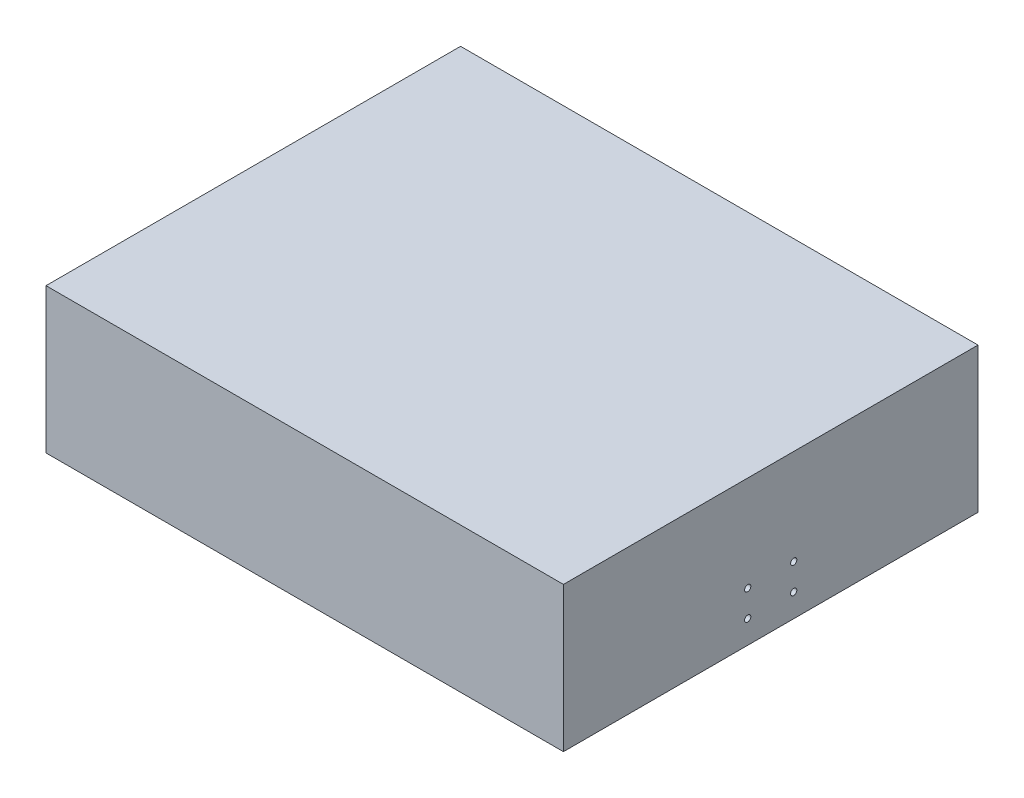
ISO-10303-21;
HEADER;
FILE_DESCRIPTION(('STEP AP214'),'2;1');
FILE_NAME('part.step','',(''),(''),'','','');
FILE_SCHEMA(('AUTOMOTIVE_DESIGN { 1 0 10303 214 1 1 1 1 }'));
ENDSEC;
DATA;
#1=APPLICATION_CONTEXT('core data for automotive mechanical design processes');
#2=APPLICATION_PROTOCOL_DEFINITION('international standard','automotive_design',2000,#1);
#3=PRODUCT_CONTEXT('',#1,'mechanical');
#4=PRODUCT('Part','Part','',(#3));
#5=PRODUCT_RELATED_PRODUCT_CATEGORY('part','',(#4));
#6=PRODUCT_DEFINITION_FORMATION('','',#4);
#7=PRODUCT_DEFINITION_CONTEXT('part definition',#1,'design');
#8=PRODUCT_DEFINITION('design','',#6,#7);
#9=PRODUCT_DEFINITION_SHAPE('','',#8);
#10=(LENGTH_UNIT() NAMED_UNIT(*) SI_UNIT(.MILLI.,.METRE.));
#11=(NAMED_UNIT(*) PLANE_ANGLE_UNIT() SI_UNIT($,.RADIAN.));
#12=(NAMED_UNIT(*) SI_UNIT($,.STERADIAN.) SOLID_ANGLE_UNIT());
#13=UNCERTAINTY_MEASURE_WITH_UNIT(LENGTH_MEASURE(1.E-05),#10,'distance_accuracy_value','');
#14=(GEOMETRIC_REPRESENTATION_CONTEXT(3) GLOBAL_UNCERTAINTY_ASSIGNED_CONTEXT((#13)) GLOBAL_UNIT_ASSIGNED_CONTEXT((#10,
#11,#12)) REPRESENTATION_CONTEXT('',''));
#15=CARTESIAN_POINT('',(0.,0.,0.));
#16=DIRECTION('',(0.,0.,1.));
#17=DIRECTION('',(1.,0.,0.));
#18=AXIS2_PLACEMENT_3D('',#15,#16,#17);
#19=CARTESIAN_POINT('',(-125.,70.,100.15));
#20=DIRECTION('',(1.,0.,0.));
#21=DIRECTION('',(0.,0.,-1.));
#22=AXIS2_PLACEMENT_3D('',#19,#20,#21);
#23=PLANE('',#22);
#24=DIRECTION('',(0.,0.,1.));
#25=VECTOR('',#24,1.);
#26=CARTESIAN_POINT('',(-125.,0.,100.15));
#27=LINE('',#26,#25);
#28=CARTESIAN_POINT('',(-125.,0.,-100.15));
#29=VERTEX_POINT('',#28);
#30=CARTESIAN_POINT('',(-125.,0.,100.15));
#31=VERTEX_POINT('',#30);
#32=EDGE_CURVE('E168',#29,#31,#27,.T.);
#33=ORIENTED_EDGE('',*,*,#32,.T.);
#34=DIRECTION('',(0.,-1.,0.));
#35=VECTOR('',#34,1.);
#36=CARTESIAN_POINT('',(-125.,70.,100.15));
#37=LINE('',#36,#35);
#38=CARTESIAN_POINT('',(-125.,70.,100.15));
#39=VERTEX_POINT('',#38);
#40=EDGE_CURVE('E11',#39,#31,#37,.T.);
#41=ORIENTED_EDGE('',*,*,#40,.F.);
#42=DIRECTION('',(0.,0.,1.));
#43=VECTOR('',#42,1.);
#44=CARTESIAN_POINT('',(-125.,70.,100.15));
#45=LINE('',#44,#43);
#46=CARTESIAN_POINT('',(-125.,70.,-100.15));
#47=VERTEX_POINT('',#46);
#48=EDGE_CURVE('E174',#47,#39,#45,.T.);
#49=ORIENTED_EDGE('',*,*,#48,.F.);
#50=DIRECTION('',(0.,-1.,0.));
#51=VECTOR('',#50,1.);
#52=CARTESIAN_POINT('',(-125.,70.,-100.15));
#53=LINE('',#52,#51);
#54=EDGE_CURVE('E184',#47,#29,#53,.T.);
#55=ORIENTED_EDGE('',*,*,#54,.T.);
#56=EDGE_LOOP('',(#33,#41,#49,#55));
#57=FACE_BOUND('',#56,.T.);
#58=ADVANCED_FACE('F45',(#57),#23,.F.);
#59=CARTESIAN_POINT('',(125.,70.,100.15));
#60=DIRECTION('',(0.,0.,-1.));
#61=DIRECTION('',(-1.,0.,0.));
#62=AXIS2_PLACEMENT_3D('',#59,#60,#61);
#63=PLANE('',#62);
#64=DIRECTION('',(1.,0.,0.));
#65=VECTOR('',#64,1.);
#66=CARTESIAN_POINT('',(125.,0.,100.15));
#67=LINE('',#66,#65);
#68=CARTESIAN_POINT('',(125.,0.,100.15));
#69=VERTEX_POINT('',#68);
#70=EDGE_CURVE('E188',#31,#69,#67,.T.);
#71=ORIENTED_EDGE('',*,*,#70,.T.);
#72=DIRECTION('',(0.,-1.,0.));
#73=VECTOR('',#72,1.);
#74=CARTESIAN_POINT('',(125.,70.,100.15));
#75=LINE('',#74,#73);
#76=CARTESIAN_POINT('',(125.,70.,100.15));
#77=VERTEX_POINT('',#76);
#78=EDGE_CURVE('E53',#77,#69,#75,.T.);
#79=ORIENTED_EDGE('',*,*,#78,.F.);
#80=DIRECTION('',(1.,0.,0.));
#81=VECTOR('',#80,1.);
#82=CARTESIAN_POINT('',(125.,70.,100.15));
#83=LINE('',#82,#81);
#84=EDGE_CURVE('E97',#39,#77,#83,.T.);
#85=ORIENTED_EDGE('',*,*,#84,.F.);
#86=ORIENTED_EDGE('',*,*,#40,.T.);
#87=EDGE_LOOP('',(#71,#79,#85,#86));
#88=FACE_BOUND('',#87,.T.);
#89=ADVANCED_FACE('F223',(#88),#63,.F.);
#90=CARTESIAN_POINT('',(125.,70.,-100.15));
#91=DIRECTION('',(-1.,0.,0.));
#92=DIRECTION('',(0.,0.,1.));
#93=AXIS2_PLACEMENT_3D('',#90,#91,#92);
#94=PLANE('',#93);
#95=CARTESIAN_POINT('',(125.,23.9000761563583,-11.1099999998695));
#96=DIRECTION('',(1.,0.,0.));
#97=DIRECTION('',(0.,0.,-1.));
#98=AXIS2_PLACEMENT_3D('',#95,#96,#97);
#99=CIRCLE('',#98,1.5);
#100=CARTESIAN_POINT('',(125.,23.9000761563583,-12.6099999998695));
#101=VERTEX_POINT('',#100);
#102=EDGE_CURVE('E497',#101,#101,#99,.T.);
#103=ORIENTED_EDGE('',*,*,#102,.F.);
#104=EDGE_LOOP('',(#103));
#105=FACE_BOUND('',#104,.T.);
#106=CARTESIAN_POINT('',(125.,11.2,11.115));
#107=DIRECTION('',(1.,0.,0.));
#108=DIRECTION('',(0.,0.,-1.));
#109=AXIS2_PLACEMENT_3D('',#106,#107,#108);
#110=CIRCLE('',#109,1.5);
#111=CARTESIAN_POINT('',(125.,11.2,9.615));
#112=VERTEX_POINT('',#111);
#113=EDGE_CURVE('E505',#112,#112,#110,.T.);
#114=ORIENTED_EDGE('',*,*,#113,.F.);
#115=EDGE_LOOP('',(#114));
#116=FACE_BOUND('',#115,.T.);
#117=CARTESIAN_POINT('',(125.,11.2,-11.11));
#118=DIRECTION('',(1.,0.,0.));
#119=DIRECTION('',(0.,0.,-1.));
#120=AXIS2_PLACEMENT_3D('',#117,#118,#119);
#121=CIRCLE('',#120,1.5);
#122=CARTESIAN_POINT('',(125.,11.2,-12.61));
#123=VERTEX_POINT('',#122);
#124=EDGE_CURVE('E489',#123,#123,#121,.T.);
#125=ORIENTED_EDGE('',*,*,#124,.F.);
#126=EDGE_LOOP('',(#125));
#127=FACE_BOUND('',#126,.T.);
#128=CARTESIAN_POINT('',(125.,23.9,11.115));
#129=DIRECTION('',(1.,0.,0.));
#130=DIRECTION('',(0.,0.,-1.));
#131=AXIS2_PLACEMENT_3D('',#128,#129,#130);
#132=CIRCLE('',#131,1.5);
#133=CARTESIAN_POINT('',(125.,23.9,9.615));
#134=VERTEX_POINT('',#133);
#135=EDGE_CURVE('E149',#134,#134,#132,.T.);
#136=ORIENTED_EDGE('',*,*,#135,.F.);
#137=EDGE_LOOP('',(#136));
#138=FACE_BOUND('',#137,.T.);
#139=DIRECTION('',(0.,0.,-1.));
#140=VECTOR('',#139,1.);
#141=CARTESIAN_POINT('',(125.,0.,-100.15));
#142=LINE('',#141,#140);
#143=CARTESIAN_POINT('',(125.,0.,-100.15));
#144=VERTEX_POINT('',#143);
#145=EDGE_CURVE('E191',#69,#144,#142,.T.);
#146=ORIENTED_EDGE('',*,*,#145,.T.);
#147=DIRECTION('',(0.,-1.,0.));
#148=VECTOR('',#147,1.);
#149=CARTESIAN_POINT('',(125.,70.,-100.15));
#150=LINE('',#149,#148);
#151=CARTESIAN_POINT('',(125.,70.,-100.15));
#152=VERTEX_POINT('',#151);
#153=EDGE_CURVE('E198',#152,#144,#150,.T.);
#154=ORIENTED_EDGE('',*,*,#153,.F.);
#155=DIRECTION('',(0.,0.,-1.));
#156=VECTOR('',#155,1.);
#157=CARTESIAN_POINT('',(125.,70.,-100.15));
#158=LINE('',#157,#156);
#159=EDGE_CURVE('E179',#77,#152,#158,.T.);
#160=ORIENTED_EDGE('',*,*,#159,.F.);
#161=ORIENTED_EDGE('',*,*,#78,.T.);
#162=EDGE_LOOP('',(#146,#154,#160,#161));
#163=FACE_BOUND('',#162,.T.);
#164=ADVANCED_FACE('F205',(#105,#116,#127,#138,#163),#94,.F.);
#165=CARTESIAN_POINT('',(-125.,70.,-100.15));
#166=DIRECTION('',(0.,0.,1.));
#167=DIRECTION('',(1.,0.,0.));
#168=AXIS2_PLACEMENT_3D('',#165,#166,#167);
#169=PLANE('',#168);
#170=DIRECTION('',(-1.,0.,0.));
#171=VECTOR('',#170,1.);
#172=CARTESIAN_POINT('',(-125.,0.,-100.15));
#173=LINE('',#172,#171);
#174=EDGE_CURVE('E90',#144,#29,#173,.T.);
#175=ORIENTED_EDGE('',*,*,#174,.T.);
#176=ORIENTED_EDGE('',*,*,#54,.F.);
#177=DIRECTION('',(-1.,0.,0.));
#178=VECTOR('',#177,1.);
#179=CARTESIAN_POINT('',(-125.,70.,-100.15));
#180=LINE('',#179,#178);
#181=EDGE_CURVE('E69',#152,#47,#180,.T.);
#182=ORIENTED_EDGE('',*,*,#181,.F.);
#183=ORIENTED_EDGE('',*,*,#153,.T.);
#184=EDGE_LOOP('',(#175,#176,#182,#183));
#185=FACE_BOUND('',#184,.T.);
#186=ADVANCED_FACE('F213',(#185),#169,.F.);
#187=CARTESIAN_POINT('',(0.,70.,0.));
#188=DIRECTION('',(0.,-1.,0.));
#189=DIRECTION('',(0.,0.,-1.));
#190=AXIS2_PLACEMENT_3D('',#187,#188,#189);
#191=PLANE('',#190);
#192=ORIENTED_EDGE('',*,*,#48,.T.);
#193=ORIENTED_EDGE('',*,*,#84,.T.);
#194=ORIENTED_EDGE('',*,*,#159,.T.);
#195=ORIENTED_EDGE('',*,*,#181,.T.);
#196=EDGE_LOOP('',(#192,#193,#194,#195));
#197=FACE_BOUND('',#196,.T.);
#198=ADVANCED_FACE('F215',(#197),#191,.F.);
#199=CARTESIAN_POINT('',(0.,0.,0.));
#200=DIRECTION('',(0.,-1.,0.));
#201=DIRECTION('',(0.,0.,-1.));
#202=AXIS2_PLACEMENT_3D('',#199,#200,#201);
#203=PLANE('',#202);
#204=CARTESIAN_POINT('',(110.,0.,95.15));
#205=DIRECTION('',(0.,-1.,0.));
#206=DIRECTION('',(0.,0.,-1.));
#207=AXIS2_PLACEMENT_3D('',#204,#205,#206);
#208=CIRCLE('',#207,2.5);
#209=CARTESIAN_POINT('',(110.,0.,92.65));
#210=VERTEX_POINT('',#209);
#211=EDGE_CURVE('E471',#210,#210,#208,.T.);
#212=ORIENTED_EDGE('',*,*,#211,.F.);
#213=EDGE_LOOP('',(#212));
#214=FACE_BOUND('',#213,.T.);
#215=CARTESIAN_POINT('',(110.,0.,-95.15));
#216=DIRECTION('',(0.,-1.,0.));
#217=DIRECTION('',(0.,0.,-1.));
#218=AXIS2_PLACEMENT_3D('',#215,#216,#217);
#219=CIRCLE('',#218,2.50000000000001);
#220=CARTESIAN_POINT('',(110.,0.,-97.65));
#221=VERTEX_POINT('',#220);
#222=EDGE_CURVE('E526',#221,#221,#219,.T.);
#223=ORIENTED_EDGE('',*,*,#222,.F.);
#224=EDGE_LOOP('',(#223));
#225=FACE_BOUND('',#224,.T.);
#226=CARTESIAN_POINT('',(-100.15,0.,-95.15));
#227=DIRECTION('',(0.,-1.,0.));
#228=DIRECTION('',(0.,0.,-1.));
#229=AXIS2_PLACEMENT_3D('',#226,#227,#228);
#230=CIRCLE('',#229,2.5);
#231=CARTESIAN_POINT('',(-100.15,0.,-97.65));
#232=VERTEX_POINT('',#231);
#233=EDGE_CURVE('E488',#232,#232,#230,.T.);
#234=ORIENTED_EDGE('',*,*,#233,.F.);
#235=EDGE_LOOP('',(#234));
#236=FACE_BOUND('',#235,.T.);
#237=CARTESIAN_POINT('',(-100.15,0.,95.15));
#238=DIRECTION('',(0.,-1.,0.));
#239=DIRECTION('',(0.,0.,-1.));
#240=AXIS2_PLACEMENT_3D('',#237,#238,#239);
#241=CIRCLE('',#240,2.50000000000001);
#242=CARTESIAN_POINT('',(-100.15,0.,92.65));
#243=VERTEX_POINT('',#242);
#244=EDGE_CURVE('E484',#243,#243,#241,.T.);
#245=ORIENTED_EDGE('',*,*,#244,.F.);
#246=EDGE_LOOP('',(#245));
#247=FACE_BOUND('',#246,.T.);
#248=DIRECTION('',(0.,0.,-1.));
#249=VECTOR('',#248,1.);
#250=CARTESIAN_POINT('',(-115.,0.,90.15));
#251=LINE('',#250,#249);
#252=CARTESIAN_POINT('',(-115.,0.,90.15));
#253=VERTEX_POINT('',#252);
#254=CARTESIAN_POINT('',(-115.,0.,-90.15));
#255=VERTEX_POINT('',#254);
#256=EDGE_CURVE('E60',#253,#255,#251,.T.);
#257=ORIENTED_EDGE('',*,*,#256,.F.);
#258=DIRECTION('',(-1.,0.,0.));
#259=VECTOR('',#258,1.);
#260=CARTESIAN_POINT('',(-115.,0.,90.15));
#261=LINE('',#260,#259);
#262=CARTESIAN_POINT('',(115.,0.,90.15));
#263=VERTEX_POINT('',#262);
#264=EDGE_CURVE('E142',#263,#253,#261,.T.);
#265=ORIENTED_EDGE('',*,*,#264,.F.);
#266=DIRECTION('',(0.,0.,1.));
#267=VECTOR('',#266,1.);
#268=CARTESIAN_POINT('',(115.,0.,90.15));
#269=LINE('',#268,#267);
#270=CARTESIAN_POINT('',(115.,0.,-90.15));
#271=VERTEX_POINT('',#270);
#272=EDGE_CURVE('E146',#271,#263,#269,.T.);
#273=ORIENTED_EDGE('',*,*,#272,.F.);
#274=DIRECTION('',(1.,0.,0.));
#275=VECTOR('',#274,1.);
#276=CARTESIAN_POINT('',(-115.,0.,-90.15));
#277=LINE('',#276,#275);
#278=EDGE_CURVE('E158',#255,#271,#277,.T.);
#279=ORIENTED_EDGE('',*,*,#278,.F.);
#280=EDGE_LOOP('',(#257,#265,#273,#279));
#281=FACE_BOUND('',#280,.T.);
#282=ORIENTED_EDGE('',*,*,#32,.F.);
#283=ORIENTED_EDGE('',*,*,#174,.F.);
#284=ORIENTED_EDGE('',*,*,#145,.F.);
#285=ORIENTED_EDGE('',*,*,#70,.F.);
#286=EDGE_LOOP('',(#282,#283,#284,#285));
#287=FACE_BOUND('',#286,.T.);
#288=ADVANCED_FACE('F209',(#214,#225,#236,#247,#281,#287),#203,.T.);
#289=CARTESIAN_POINT('',(-115.,60.,90.15));
#290=DIRECTION('',(-1.,0.,0.));
#291=DIRECTION('',(0.,0.,1.));
#292=AXIS2_PLACEMENT_3D('',#289,#290,#291);
#293=PLANE('',#292);
#294=ORIENTED_EDGE('',*,*,#256,.T.);
#295=DIRECTION('',(0.,-1.,0.));
#296=VECTOR('',#295,1.);
#297=CARTESIAN_POINT('',(-115.,60.,-90.15));
#298=LINE('',#297,#296);
#299=CARTESIAN_POINT('',(-115.,60.,-90.15));
#300=VERTEX_POINT('',#299);
#301=EDGE_CURVE('E117',#300,#255,#298,.T.);
#302=ORIENTED_EDGE('',*,*,#301,.F.);
#303=DIRECTION('',(0.,0.,-1.));
#304=VECTOR('',#303,1.);
#305=CARTESIAN_POINT('',(-115.,60.,90.15));
#306=LINE('',#305,#304);
#307=CARTESIAN_POINT('',(-115.,60.,90.15));
#308=VERTEX_POINT('',#307);
#309=EDGE_CURVE('E121',#308,#300,#306,.T.);
#310=ORIENTED_EDGE('',*,*,#309,.F.);
#311=DIRECTION('',(0.,-1.,0.));
#312=VECTOR('',#311,1.);
#313=CARTESIAN_POINT('',(-115.,60.,90.15));
#314=LINE('',#313,#312);
#315=EDGE_CURVE('E165',#308,#253,#314,.T.);
#316=ORIENTED_EDGE('',*,*,#315,.T.);
#317=EDGE_LOOP('',(#294,#302,#310,#316));
#318=FACE_BOUND('',#317,.T.);
#319=ADVANCED_FACE('F119',(#318),#293,.F.);
#320=CARTESIAN_POINT('',(-115.,60.,90.15));
#321=DIRECTION('',(0.,0.,1.));
#322=DIRECTION('',(1.,0.,0.));
#323=AXIS2_PLACEMENT_3D('',#320,#321,#322);
#324=PLANE('',#323);
#325=ORIENTED_EDGE('',*,*,#264,.T.);
#326=ORIENTED_EDGE('',*,*,#315,.F.);
#327=DIRECTION('',(-1.,0.,0.));
#328=VECTOR('',#327,1.);
#329=CARTESIAN_POINT('',(-115.,60.,90.15));
#330=LINE('',#329,#328);
#331=CARTESIAN_POINT('',(115.,60.,90.15));
#332=VERTEX_POINT('',#331);
#333=EDGE_CURVE('E128',#332,#308,#330,.T.);
#334=ORIENTED_EDGE('',*,*,#333,.F.);
#335=DIRECTION('',(0.,-1.,0.));
#336=VECTOR('',#335,1.);
#337=CARTESIAN_POINT('',(115.,60.,90.15));
#338=LINE('',#337,#336);
#339=EDGE_CURVE('E169',#332,#263,#338,.T.);
#340=ORIENTED_EDGE('',*,*,#339,.T.);
#341=EDGE_LOOP('',(#325,#326,#334,#340));
#342=FACE_BOUND('',#341,.T.);
#343=ADVANCED_FACE('F273',(#342),#324,.F.);
#344=CARTESIAN_POINT('',(115.,60.,90.15));
#345=DIRECTION('',(1.,0.,0.));
#346=DIRECTION('',(0.,0.,-1.));
#347=AXIS2_PLACEMENT_3D('',#344,#345,#346);
#348=PLANE('',#347);
#349=ORIENTED_EDGE('',*,*,#272,.T.);
#350=ORIENTED_EDGE('',*,*,#339,.F.);
#351=DIRECTION('',(0.,0.,1.));
#352=VECTOR('',#351,1.);
#353=CARTESIAN_POINT('',(115.,60.,90.15));
#354=LINE('',#353,#352);
#355=CARTESIAN_POINT('',(115.,60.,-90.15));
#356=VERTEX_POINT('',#355);
#357=EDGE_CURVE('E137',#356,#332,#354,.T.);
#358=ORIENTED_EDGE('',*,*,#357,.F.);
#359=DIRECTION('',(0.,-1.,0.));
#360=VECTOR('',#359,1.);
#361=CARTESIAN_POINT('',(115.,60.,-90.15));
#362=LINE('',#361,#360);
#363=EDGE_CURVE('E127',#356,#271,#362,.T.);
#364=ORIENTED_EDGE('',*,*,#363,.T.);
#365=EDGE_LOOP('',(#349,#350,#358,#364));
#366=FACE_BOUND('',#365,.T.);
#367=ADVANCED_FACE('F282',(#366),#348,.F.);
#368=CARTESIAN_POINT('',(-115.,60.,-90.15));
#369=DIRECTION('',(0.,0.,-1.));
#370=DIRECTION('',(-1.,0.,0.));
#371=AXIS2_PLACEMENT_3D('',#368,#369,#370);
#372=PLANE('',#371);
#373=ORIENTED_EDGE('',*,*,#278,.T.);
#374=ORIENTED_EDGE('',*,*,#363,.F.);
#375=DIRECTION('',(1.,0.,0.));
#376=VECTOR('',#375,1.);
#377=CARTESIAN_POINT('',(-115.,60.,-90.15));
#378=LINE('',#377,#376);
#379=EDGE_CURVE('E131',#300,#356,#378,.T.);
#380=ORIENTED_EDGE('',*,*,#379,.F.);
#381=ORIENTED_EDGE('',*,*,#301,.T.);
#382=EDGE_LOOP('',(#373,#374,#380,#381));
#383=FACE_BOUND('',#382,.T.);
#384=ADVANCED_FACE('F132',(#383),#372,.F.);
#385=CARTESIAN_POINT('',(0.,60.,0.));
#386=DIRECTION('',(0.,-1.,0.));
#387=DIRECTION('',(0.,0.,-1.));
#388=AXIS2_PLACEMENT_3D('',#385,#386,#387);
#389=PLANE('',#388);
#390=ORIENTED_EDGE('',*,*,#309,.T.);
#391=ORIENTED_EDGE('',*,*,#379,.T.);
#392=ORIENTED_EDGE('',*,*,#357,.T.);
#393=ORIENTED_EDGE('',*,*,#333,.T.);
#394=EDGE_LOOP('',(#390,#391,#392,#393));
#395=FACE_BOUND('',#394,.T.);
#396=ADVANCED_FACE('F139',(#395),#389,.T.);
#397=CARTESIAN_POINT('',(120.,23.9,11.115));
#398=DIRECTION('',(1.,0.,0.));
#399=DIRECTION('',(0.,0.,-1.));
#400=AXIS2_PLACEMENT_3D('',#397,#398,#399);
#401=CYLINDRICAL_SURFACE('',#400,1.5);
#402=CARTESIAN_POINT('',(120.,23.9,11.115));
#403=DIRECTION('',(1.,0.,0.));
#404=DIRECTION('',(0.,0.,-1.));
#405=AXIS2_PLACEMENT_3D('',#402,#403,#404);
#406=CIRCLE('',#405,1.5);
#407=CARTESIAN_POINT('',(120.,23.9,9.615));
#408=VERTEX_POINT('',#407);
#409=EDGE_CURVE('E159',#408,#408,#406,.T.);
#410=ORIENTED_EDGE('',*,*,#409,.F.);
#411=EDGE_LOOP('',(#410));
#412=FACE_BOUND('',#411,.T.);
#413=ORIENTED_EDGE('',*,*,#135,.T.);
#414=EDGE_LOOP('',(#413));
#415=FACE_BOUND('',#414,.T.);
#416=ADVANCED_FACE('F308',(#412,#415),#401,.F.);
#417=CARTESIAN_POINT('',(120.,23.9,11.115));
#418=DIRECTION('',(1.,0.,0.));
#419=DIRECTION('',(0.,0.,-1.));
#420=AXIS2_PLACEMENT_3D('',#417,#418,#419);
#421=PLANE('',#420);
#422=ORIENTED_EDGE('',*,*,#409,.T.);
#423=EDGE_LOOP('',(#422));
#424=FACE_BOUND('',#423,.T.);
#425=ADVANCED_FACE('F316',(#424),#421,.T.);
#426=CARTESIAN_POINT('',(120.,11.2,-11.11));
#427=DIRECTION('',(1.,0.,0.));
#428=DIRECTION('',(0.,0.,-1.));
#429=AXIS2_PLACEMENT_3D('',#426,#427,#428);
#430=CYLINDRICAL_SURFACE('',#429,1.5);
#431=CARTESIAN_POINT('',(120.,11.2,-11.11));
#432=DIRECTION('',(1.,0.,0.));
#433=DIRECTION('',(0.,0.,-1.));
#434=AXIS2_PLACEMENT_3D('',#431,#432,#433);
#435=CIRCLE('',#434,1.5);
#436=CARTESIAN_POINT('',(120.,11.2,-12.61));
#437=VERTEX_POINT('',#436);
#438=EDGE_CURVE('E483',#437,#437,#435,.T.);
#439=ORIENTED_EDGE('',*,*,#438,.F.);
#440=EDGE_LOOP('',(#439));
#441=FACE_BOUND('',#440,.T.);
#442=ORIENTED_EDGE('',*,*,#124,.T.);
#443=EDGE_LOOP('',(#442));
#444=FACE_BOUND('',#443,.T.);
#445=ADVANCED_FACE('F326',(#441,#444),#430,.F.);
#446=CARTESIAN_POINT('',(120.,11.2,-11.11));
#447=DIRECTION('',(1.,0.,0.));
#448=DIRECTION('',(0.,0.,-1.));
#449=AXIS2_PLACEMENT_3D('',#446,#447,#448);
#450=PLANE('',#449);
#451=ORIENTED_EDGE('',*,*,#438,.T.);
#452=EDGE_LOOP('',(#451));
#453=FACE_BOUND('',#452,.T.);
#454=ADVANCED_FACE('F336',(#453),#450,.T.);
#455=CARTESIAN_POINT('',(120.,11.2,11.115));
#456=DIRECTION('',(1.,0.,0.));
#457=DIRECTION('',(0.,0.,-1.));
#458=AXIS2_PLACEMENT_3D('',#455,#456,#457);
#459=CYLINDRICAL_SURFACE('',#458,1.5);
#460=CARTESIAN_POINT('',(120.,11.2,11.115));
#461=DIRECTION('',(1.,0.,0.));
#462=DIRECTION('',(0.,0.,-1.));
#463=AXIS2_PLACEMENT_3D('',#460,#461,#462);
#464=CIRCLE('',#463,1.5);
#465=CARTESIAN_POINT('',(120.,11.2,9.615));
#466=VERTEX_POINT('',#465);
#467=EDGE_CURVE('E493',#466,#466,#464,.T.);
#468=ORIENTED_EDGE('',*,*,#467,.F.);
#469=EDGE_LOOP('',(#468));
#470=FACE_BOUND('',#469,.T.);
#471=ORIENTED_EDGE('',*,*,#113,.T.);
#472=EDGE_LOOP('',(#471));
#473=FACE_BOUND('',#472,.T.);
#474=ADVANCED_FACE('F346',(#470,#473),#459,.F.);
#475=CARTESIAN_POINT('',(120.,11.2,11.115));
#476=DIRECTION('',(1.,0.,0.));
#477=DIRECTION('',(0.,0.,-1.));
#478=AXIS2_PLACEMENT_3D('',#475,#476,#477);
#479=PLANE('',#478);
#480=ORIENTED_EDGE('',*,*,#467,.T.);
#481=EDGE_LOOP('',(#480));
#482=FACE_BOUND('',#481,.T.);
#483=ADVANCED_FACE('F356',(#482),#479,.T.);
#484=CARTESIAN_POINT('',(120.,23.9000761563583,-11.1099999998695));
#485=DIRECTION('',(1.,0.,0.));
#486=DIRECTION('',(0.,0.,-1.));
#487=AXIS2_PLACEMENT_3D('',#484,#485,#486);
#488=CYLINDRICAL_SURFACE('',#487,1.5);
#489=CARTESIAN_POINT('',(120.,23.9000761563583,-11.1099999998695));
#490=DIRECTION('',(1.,0.,0.));
#491=DIRECTION('',(0.,0.,-1.));
#492=AXIS2_PLACEMENT_3D('',#489,#490,#491);
#493=CIRCLE('',#492,1.5);
#494=CARTESIAN_POINT('',(120.,23.9000761563583,-12.6099999998695));
#495=VERTEX_POINT('',#494);
#496=EDGE_CURVE('E501',#495,#495,#493,.T.);
#497=ORIENTED_EDGE('',*,*,#496,.F.);
#498=EDGE_LOOP('',(#497));
#499=FACE_BOUND('',#498,.T.);
#500=ORIENTED_EDGE('',*,*,#102,.T.);
#501=EDGE_LOOP('',(#500));
#502=FACE_BOUND('',#501,.T.);
#503=ADVANCED_FACE('F366',(#499,#502),#488,.F.);
#504=CARTESIAN_POINT('',(120.,23.9000761563583,-11.1099999998695));
#505=DIRECTION('',(1.,0.,0.));
#506=DIRECTION('',(0.,0.,-1.));
#507=AXIS2_PLACEMENT_3D('',#504,#505,#506);
#508=PLANE('',#507);
#509=ORIENTED_EDGE('',*,*,#496,.T.);
#510=EDGE_LOOP('',(#509));
#511=FACE_BOUND('',#510,.T.);
#512=ADVANCED_FACE('F376',(#511),#508,.T.);
#513=CARTESIAN_POINT('',(-100.15,8.,95.15));
#514=DIRECTION('',(0.,-1.,0.));
#515=DIRECTION('',(0.,0.,-1.));
#516=AXIS2_PLACEMENT_3D('',#513,#514,#515);
#517=CYLINDRICAL_SURFACE('',#516,2.50000000000001);
#518=CARTESIAN_POINT('',(-100.15,8.,95.15));
#519=DIRECTION('',(0.,-1.,0.));
#520=DIRECTION('',(0.,0.,-1.));
#521=AXIS2_PLACEMENT_3D('',#518,#519,#520);
#522=CIRCLE('',#521,2.50000000000001);
#523=CARTESIAN_POINT('',(-100.15,8.,92.65));
#524=VERTEX_POINT('',#523);
#525=EDGE_CURVE('E479',#524,#524,#522,.T.);
#526=ORIENTED_EDGE('',*,*,#525,.F.);
#527=EDGE_LOOP('',(#526));
#528=FACE_BOUND('',#527,.T.);
#529=ORIENTED_EDGE('',*,*,#244,.T.);
#530=EDGE_LOOP('',(#529));
#531=FACE_BOUND('',#530,.T.);
#532=ADVANCED_FACE('F385',(#528,#531),#517,.F.);
#533=CARTESIAN_POINT('',(-100.15,8.,95.15));
#534=DIRECTION('',(0.,-1.,0.));
#535=DIRECTION('',(0.,0.,-1.));
#536=AXIS2_PLACEMENT_3D('',#533,#534,#535);
#537=PLANE('',#536);
#538=ORIENTED_EDGE('',*,*,#525,.T.);
#539=EDGE_LOOP('',(#538));
#540=FACE_BOUND('',#539,.T.);
#541=ADVANCED_FACE('F394',(#540),#537,.T.);
#542=CARTESIAN_POINT('',(-100.15,8.,-95.15));
#543=DIRECTION('',(0.,-1.,0.));
#544=DIRECTION('',(0.,0.,-1.));
#545=AXIS2_PLACEMENT_3D('',#542,#543,#544);
#546=CYLINDRICAL_SURFACE('',#545,2.5);
#547=CARTESIAN_POINT('',(-100.15,8.,-95.15));
#548=DIRECTION('',(0.,-1.,0.));
#549=DIRECTION('',(0.,0.,-1.));
#550=AXIS2_PLACEMENT_3D('',#547,#548,#549);
#551=CIRCLE('',#550,2.5);
#552=CARTESIAN_POINT('',(-100.15,8.,-97.65));
#553=VERTEX_POINT('',#552);
#554=EDGE_CURVE('E522',#553,#553,#551,.T.);
#555=ORIENTED_EDGE('',*,*,#554,.F.);
#556=EDGE_LOOP('',(#555));
#557=FACE_BOUND('',#556,.T.);
#558=ORIENTED_EDGE('',*,*,#233,.T.);
#559=EDGE_LOOP('',(#558));
#560=FACE_BOUND('',#559,.T.);
#561=ADVANCED_FACE('F404',(#557,#560),#546,.F.);
#562=CARTESIAN_POINT('',(-100.15,8.,-95.15));
#563=DIRECTION('',(0.,-1.,0.));
#564=DIRECTION('',(0.,0.,-1.));
#565=AXIS2_PLACEMENT_3D('',#562,#563,#564);
#566=PLANE('',#565);
#567=ORIENTED_EDGE('',*,*,#554,.T.);
#568=EDGE_LOOP('',(#567));
#569=FACE_BOUND('',#568,.T.);
#570=ADVANCED_FACE('F414',(#569),#566,.T.);
#571=CARTESIAN_POINT('',(110.,8.,-95.15));
#572=DIRECTION('',(0.,-1.,0.));
#573=DIRECTION('',(0.,0.,-1.));
#574=AXIS2_PLACEMENT_3D('',#571,#572,#573);
#575=CYLINDRICAL_SURFACE('',#574,2.50000000000001);
#576=CARTESIAN_POINT('',(110.,8.,-95.15));
#577=DIRECTION('',(0.,-1.,0.));
#578=DIRECTION('',(0.,0.,-1.));
#579=AXIS2_PLACEMENT_3D('',#576,#577,#578);
#580=CIRCLE('',#579,2.50000000000001);
#581=CARTESIAN_POINT('',(110.,8.,-97.65));
#582=VERTEX_POINT('',#581);
#583=EDGE_CURVE('E475',#582,#582,#580,.T.);
#584=ORIENTED_EDGE('',*,*,#583,.F.);
#585=EDGE_LOOP('',(#584));
#586=FACE_BOUND('',#585,.T.);
#587=ORIENTED_EDGE('',*,*,#222,.T.);
#588=EDGE_LOOP('',(#587));
#589=FACE_BOUND('',#588,.T.);
#590=ADVANCED_FACE('F424',(#586,#589),#575,.F.);
#591=CARTESIAN_POINT('',(110.,8.,-95.15));
#592=DIRECTION('',(0.,-1.,0.));
#593=DIRECTION('',(0.,0.,-1.));
#594=AXIS2_PLACEMENT_3D('',#591,#592,#593);
#595=PLANE('',#594);
#596=ORIENTED_EDGE('',*,*,#583,.T.);
#597=EDGE_LOOP('',(#596));
#598=FACE_BOUND('',#597,.T.);
#599=ADVANCED_FACE('F434',(#598),#595,.T.);
#600=CARTESIAN_POINT('',(110.,8.,95.15));
#601=DIRECTION('',(0.,-1.,0.));
#602=DIRECTION('',(0.,0.,-1.));
#603=AXIS2_PLACEMENT_3D('',#600,#601,#602);
#604=CYLINDRICAL_SURFACE('',#603,2.5);
#605=CARTESIAN_POINT('',(110.,8.,95.15));
#606=DIRECTION('',(0.,-1.,0.));
#607=DIRECTION('',(0.,0.,-1.));
#608=AXIS2_PLACEMENT_3D('',#605,#606,#607);
#609=CIRCLE('',#608,2.5);
#610=CARTESIAN_POINT('',(110.,8.,92.65));
#611=VERTEX_POINT('',#610);
#612=EDGE_CURVE('E469',#611,#611,#609,.T.);
#613=ORIENTED_EDGE('',*,*,#612,.F.);
#614=EDGE_LOOP('',(#613));
#615=FACE_BOUND('',#614,.T.);
#616=ORIENTED_EDGE('',*,*,#211,.T.);
#617=EDGE_LOOP('',(#616));
#618=FACE_BOUND('',#617,.T.);
#619=ADVANCED_FACE('F444',(#615,#618),#604,.F.);
#620=CARTESIAN_POINT('',(110.,8.,95.15));
#621=DIRECTION('',(0.,-1.,0.));
#622=DIRECTION('',(0.,0.,-1.));
#623=AXIS2_PLACEMENT_3D('',#620,#621,#622);
#624=PLANE('',#623);
#625=ORIENTED_EDGE('',*,*,#612,.T.);
#626=EDGE_LOOP('',(#625));
#627=FACE_BOUND('',#626,.T.);
#628=ADVANCED_FACE('F454',(#627),#624,.T.);
#629=CLOSED_SHELL('',(#58,#89,#164,#186,#198,#288,#319,#343,#367,#384,#396,#416,#425,#445,#454,
#474,#483,#503,#512,#532,#541,#561,#570,#590,#599,#619,#628));
#630=MANIFOLD_SOLID_BREP('B2',#629);
#631=ADVANCED_BREP_SHAPE_REPRESENTATION('',(#18,#630),#14);
#632=SHAPE_DEFINITION_REPRESENTATION(#9,#631);
ENDSEC;
END-ISO-10303-21;
